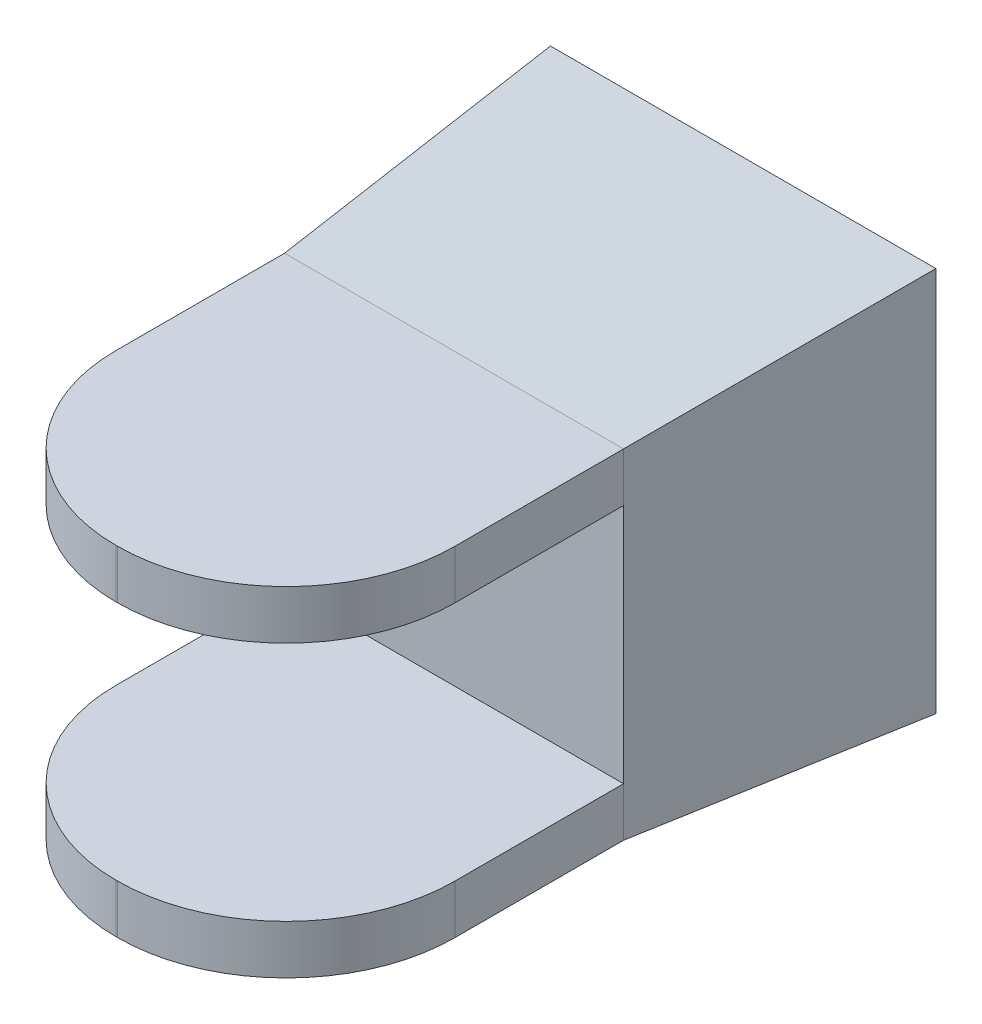
ISO-10303-21;
HEADER;
FILE_DESCRIPTION(('STEP AP214'),'2;1');
FILE_NAME('part.step','',(''),(''),'','','');
FILE_SCHEMA(('AUTOMOTIVE_DESIGN { 1 0 10303 214 1 1 1 1 }'));
ENDSEC;
DATA;
#1=APPLICATION_CONTEXT('core data for automotive mechanical design processes');
#2=APPLICATION_PROTOCOL_DEFINITION('international standard','automotive_design',2000,#1);
#3=PRODUCT_CONTEXT('',#1,'mechanical');
#4=PRODUCT('Part','Part','',(#3));
#5=PRODUCT_RELATED_PRODUCT_CATEGORY('part','',(#4));
#6=PRODUCT_DEFINITION_FORMATION('','',#4);
#7=PRODUCT_DEFINITION_CONTEXT('part definition',#1,'design');
#8=PRODUCT_DEFINITION('design','',#6,#7);
#9=PRODUCT_DEFINITION_SHAPE('','',#8);
#10=(LENGTH_UNIT() NAMED_UNIT(*) SI_UNIT(.MILLI.,.METRE.));
#11=(NAMED_UNIT(*) PLANE_ANGLE_UNIT() SI_UNIT($,.RADIAN.));
#12=(NAMED_UNIT(*) SI_UNIT($,.STERADIAN.) SOLID_ANGLE_UNIT());
#13=UNCERTAINTY_MEASURE_WITH_UNIT(LENGTH_MEASURE(1.E-05),#10,'distance_accuracy_value','');
#14=(GEOMETRIC_REPRESENTATION_CONTEXT(3) GLOBAL_UNCERTAINTY_ASSIGNED_CONTEXT((#13)) GLOBAL_UNIT_ASSIGNED_CONTEXT((#10,
#11,#12)) REPRESENTATION_CONTEXT('',''));
#15=CARTESIAN_POINT('',(0.,0.,0.));
#16=DIRECTION('',(0.,0.,1.));
#17=DIRECTION('',(1.,0.,0.));
#18=AXIS2_PLACEMENT_3D('',#15,#16,#17);
#19=CARTESIAN_POINT('',(0.172514623118826,-35.1725146231188,95.));
#20=DIRECTION('',(0.,-1.,0.));
#21=DIRECTION('',(0.,0.,-1.));
#22=AXIS2_PLACEMENT_3D('',#19,#20,#21);
#23=CYLINDRICAL_SURFACE('',#22,35.);
#24=CARTESIAN_POINT('',(0.172514623118826,25.,95.));
#25=DIRECTION('',(0.,1.,0.));
#26=DIRECTION('',(0.,0.,1.));
#27=AXIS2_PLACEMENT_3D('',#24,#25,#26);
#28=CIRCLE('',#27,35.);
#29=CARTESIAN_POINT('',(35.1725146231188,25.,95.));
#30=VERTEX_POINT('',#29);
#31=CARTESIAN_POINT('',(0.172514623118826,25.,130.));
#32=VERTEX_POINT('',#31);
#33=EDGE_CURVE('E215',#30,#32,#28,.F.);
#34=ORIENTED_EDGE('',*,*,#33,.F.);
#35=DIRECTION('',(0.,-1.,0.));
#36=VECTOR('',#35,1.);
#37=CARTESIAN_POINT('',(35.1725146231188,-35.1725146231188,95.));
#38=LINE('',#37,#36);
#39=CARTESIAN_POINT('',(35.1725146231188,35.1725146231188,95.));
#40=VERTEX_POINT('',#39);
#41=EDGE_CURVE('E195',#40,#30,#38,.T.);
#42=ORIENTED_EDGE('',*,*,#41,.F.);
#43=CARTESIAN_POINT('',(0.172514623118826,35.1725146231188,95.));
#44=DIRECTION('',(0.,-1.,0.));
#45=DIRECTION('',(0.,0.,-1.));
#46=AXIS2_PLACEMENT_3D('',#43,#44,#45);
#47=CIRCLE('',#46,35.);
#48=CARTESIAN_POINT('',(0.172514623118826,35.1725146231188,130.));
#49=VERTEX_POINT('',#48);
#50=EDGE_CURVE('E202',#49,#40,#47,.F.);
#51=ORIENTED_EDGE('',*,*,#50,.F.);
#52=DIRECTION('',(0.,-1.,0.));
#53=VECTOR('',#52,1.);
#54=CARTESIAN_POINT('',(0.172514623118826,0.,130.));
#55=LINE('',#54,#53);
#56=EDGE_CURVE('E198',#32,#49,#55,.F.);
#57=ORIENTED_EDGE('',*,*,#56,.F.);
#58=EDGE_LOOP('',(#34,#42,#51,#57));
#59=FACE_BOUND('',#58,.T.);
#60=ADVANCED_FACE('F34',(#59),#23,.T.);
#61=CARTESIAN_POINT('',(-0.172514623118826,-35.1725146231188,95.));
#62=DIRECTION('',(0.,1.,0.));
#63=DIRECTION('',(0.,0.,1.));
#64=AXIS2_PLACEMENT_3D('',#61,#62,#63);
#65=CYLINDRICAL_SURFACE('',#64,35.);
#66=CARTESIAN_POINT('',(-0.172514623118826,25.,95.));
#67=DIRECTION('',(0.,1.,0.));
#68=DIRECTION('',(0.,0.,1.));
#69=AXIS2_PLACEMENT_3D('',#66,#67,#68);
#70=CIRCLE('',#69,35.);
#71=CARTESIAN_POINT('',(-0.172514623118826,25.,130.));
#72=VERTEX_POINT('',#71);
#73=CARTESIAN_POINT('',(-35.1725146231188,25.,95.));
#74=VERTEX_POINT('',#73);
#75=EDGE_CURVE('E219',#72,#74,#70,.F.);
#76=ORIENTED_EDGE('',*,*,#75,.F.);
#77=DIRECTION('',(0.,1.,0.));
#78=VECTOR('',#77,1.);
#79=CARTESIAN_POINT('',(-0.172514623118826,0.,130.));
#80=LINE('',#79,#78);
#81=CARTESIAN_POINT('',(-0.172514623118826,35.1725146231188,130.));
#82=VERTEX_POINT('',#81);
#83=EDGE_CURVE('E186',#82,#72,#80,.F.);
#84=ORIENTED_EDGE('',*,*,#83,.F.);
#85=CARTESIAN_POINT('',(-0.172514623118826,35.1725146231188,95.));
#86=DIRECTION('',(0.,-1.,0.));
#87=DIRECTION('',(0.,0.,-1.));
#88=AXIS2_PLACEMENT_3D('',#85,#86,#87);
#89=CIRCLE('',#88,35.);
#90=CARTESIAN_POINT('',(-35.1725146231188,35.1725146231188,95.));
#91=VERTEX_POINT('',#90);
#92=EDGE_CURVE('E191',#91,#82,#89,.F.);
#93=ORIENTED_EDGE('',*,*,#92,.F.);
#94=DIRECTION('',(0.,1.,0.));
#95=VECTOR('',#94,1.);
#96=CARTESIAN_POINT('',(-35.1725146231188,-35.1725146231188,95.));
#97=LINE('',#96,#95);
#98=EDGE_CURVE('E185',#74,#91,#97,.T.);
#99=ORIENTED_EDGE('',*,*,#98,.F.);
#100=EDGE_LOOP('',(#76,#84,#93,#99));
#101=FACE_BOUND('',#100,.T.);
#102=ADVANCED_FACE('F286',(#101),#65,.T.);
#103=CARTESIAN_POINT('',(-35.1725146231188,-35.1725146231188,130.));
#104=DIRECTION('',(1.,0.,0.));
#105=DIRECTION('',(0.,0.,-1.));
#106=AXIS2_PLACEMENT_3D('',#103,#104,#105);
#107=PLANE('',#106);
#108=DIRECTION('',(0.,1.,0.));
#109=VECTOR('',#108,1.);
#110=CARTESIAN_POINT('',(-35.1725146231188,0.,60.));
#111=LINE('',#110,#109);
#112=CARTESIAN_POINT('',(-35.1725146231188,35.1725146231188,60.));
#113=VERTEX_POINT('',#112);
#114=CARTESIAN_POINT('',(-35.1725146231188,25.,60.));
#115=VERTEX_POINT('',#114);
#116=EDGE_CURVE('E171',#113,#115,#111,.F.);
#117=ORIENTED_EDGE('',*,*,#116,.T.);
#118=DIRECTION('',(0.,0.,1.));
#119=VECTOR('',#118,1.);
#120=CARTESIAN_POINT('',(-35.1725146231188,25.,60.));
#121=LINE('',#120,#119);
#122=EDGE_CURVE('E280',#115,#74,#121,.T.);
#123=ORIENTED_EDGE('',*,*,#122,.T.);
#124=ORIENTED_EDGE('',*,*,#98,.T.);
#125=DIRECTION('',(0.,0.,-1.));
#126=VECTOR('',#125,1.);
#127=CARTESIAN_POINT('',(-35.1725146231188,35.1725146231188,130.));
#128=LINE('',#127,#126);
#129=EDGE_CURVE('E217',#91,#113,#128,.T.);
#130=ORIENTED_EDGE('',*,*,#129,.T.);
#131=EDGE_LOOP('',(#117,#123,#124,#130));
#132=FACE_BOUND('',#131,.T.);
#133=ADVANCED_FACE('F279',(#132),#107,.F.);
#134=CARTESIAN_POINT('',(35.1725146231188,-35.1725146231188,130.));
#135=DIRECTION('',(-1.,0.,0.));
#136=DIRECTION('',(0.,0.,1.));
#137=AXIS2_PLACEMENT_3D('',#134,#135,#136);
#138=PLANE('',#137);
#139=ORIENTED_EDGE('',*,*,#41,.T.);
#140=DIRECTION('',(0.,0.,1.));
#141=VECTOR('',#140,1.);
#142=CARTESIAN_POINT('',(35.1725146231188,25.,60.));
#143=LINE('',#142,#141);
#144=CARTESIAN_POINT('',(35.1725146231188,25.,60.));
#145=VERTEX_POINT('',#144);
#146=EDGE_CURVE('E257',#145,#30,#143,.T.);
#147=ORIENTED_EDGE('',*,*,#146,.F.);
#148=DIRECTION('',(0.,-1.,0.));
#149=VECTOR('',#148,1.);
#150=CARTESIAN_POINT('',(35.1725146231188,0.,60.));
#151=LINE('',#150,#149);
#152=CARTESIAN_POINT('',(35.1725146231188,35.1725146231188,60.));
#153=VERTEX_POINT('',#152);
#154=EDGE_CURVE('E240',#145,#153,#151,.F.);
#155=ORIENTED_EDGE('',*,*,#154,.T.);
#156=DIRECTION('',(0.,0.,-1.));
#157=VECTOR('',#156,1.);
#158=CARTESIAN_POINT('',(35.1725146231188,35.1725146231188,130.));
#159=LINE('',#158,#157);
#160=EDGE_CURVE('E224',#40,#153,#159,.T.);
#161=ORIENTED_EDGE('',*,*,#160,.F.);
#162=EDGE_LOOP('',(#139,#147,#155,#161));
#163=FACE_BOUND('',#162,.T.);
#164=ADVANCED_FACE('F256',(#163),#138,.F.);
#165=CARTESIAN_POINT('',(0.,0.,130.));
#166=DIRECTION('',(0.,0.,-1.));
#167=DIRECTION('',(-1.,0.,0.));
#168=AXIS2_PLACEMENT_3D('',#165,#166,#167);
#169=PLANE('',#168);
#170=ORIENTED_EDGE('',*,*,#83,.T.);
#171=DIRECTION('',(1.,0.,0.));
#172=VECTOR('',#171,1.);
#173=CARTESIAN_POINT('',(0.,25.,130.));
#174=LINE('',#173,#172);
#175=EDGE_CURVE('E11',#72,#32,#174,.T.);
#176=ORIENTED_EDGE('',*,*,#175,.T.);
#177=ORIENTED_EDGE('',*,*,#56,.T.);
#178=DIRECTION('',(-1.,0.,0.));
#179=VECTOR('',#178,1.);
#180=CARTESIAN_POINT('',(-35.1725146231188,35.1725146231188,130.));
#181=LINE('',#180,#179);
#182=EDGE_CURVE('E214',#49,#82,#181,.T.);
#183=ORIENTED_EDGE('',*,*,#182,.T.);
#184=EDGE_LOOP('',(#170,#176,#177,#183));
#185=FACE_BOUND('',#184,.T.);
#186=ADVANCED_FACE('F288',(#185),#169,.F.);
#187=CARTESIAN_POINT('',(0.172514623118826,-25.,95.));
#188=DIRECTION('',(0.,-1.,0.));
#189=DIRECTION('',(0.,0.,-1.));
#190=AXIS2_PLACEMENT_3D('',#187,#188,#189);
#191=CIRCLE('',#190,35.);
#192=CARTESIAN_POINT('',(0.172514623118826,-25.,130.));
#193=VERTEX_POINT('',#192);
#194=CARTESIAN_POINT('',(35.1725146231188,-25.,95.));
#195=VERTEX_POINT('',#194);
#196=EDGE_CURVE('E300',#193,#195,#191,.F.);
#197=ORIENTED_EDGE('',*,*,#196,.F.);
#198=CARTESIAN_POINT('',(0.172514623118826,-35.1725146231188,130.));
#199=VERTEX_POINT('',#198);
#200=EDGE_CURVE('E199',#199,#193,#55,.F.);
#201=ORIENTED_EDGE('',*,*,#200,.F.);
#202=CARTESIAN_POINT('',(0.172514623118826,-35.1725146231188,95.));
#203=DIRECTION('',(0.,1.,0.));
#204=DIRECTION('',(0.,0.,1.));
#205=AXIS2_PLACEMENT_3D('',#202,#203,#204);
#206=CIRCLE('',#205,35.);
#207=CARTESIAN_POINT('',(35.1725146231188,-35.1725146231188,95.));
#208=VERTEX_POINT('',#207);
#209=EDGE_CURVE('E57',#208,#199,#206,.F.);
#210=ORIENTED_EDGE('',*,*,#209,.F.);
#211=EDGE_CURVE('E194',#195,#208,#38,.T.);
#212=ORIENTED_EDGE('',*,*,#211,.F.);
#213=EDGE_LOOP('',(#197,#201,#210,#212));
#214=FACE_BOUND('',#213,.T.);
#215=ADVANCED_FACE('F36',(#214),#23,.T.);
#216=CARTESIAN_POINT('',(-0.172514623118826,-25.,95.));
#217=DIRECTION('',(0.,-1.,0.));
#218=DIRECTION('',(0.,0.,-1.));
#219=AXIS2_PLACEMENT_3D('',#216,#217,#218);
#220=CIRCLE('',#219,35.);
#221=CARTESIAN_POINT('',(-35.1725146231188,-25.,95.));
#222=VERTEX_POINT('',#221);
#223=CARTESIAN_POINT('',(-0.172514623118826,-25.,130.));
#224=VERTEX_POINT('',#223);
#225=EDGE_CURVE('E49',#222,#224,#220,.F.);
#226=ORIENTED_EDGE('',*,*,#225,.F.);
#227=CARTESIAN_POINT('',(-35.1725146231188,-35.1725146231188,95.));
#228=VERTEX_POINT('',#227);
#229=EDGE_CURVE('E164',#228,#222,#97,.T.);
#230=ORIENTED_EDGE('',*,*,#229,.F.);
#231=CARTESIAN_POINT('',(-0.172514623118826,-35.1725146231188,95.));
#232=DIRECTION('',(0.,1.,0.));
#233=DIRECTION('',(0.,0.,1.));
#234=AXIS2_PLACEMENT_3D('',#231,#232,#233);
#235=CIRCLE('',#234,35.);
#236=CARTESIAN_POINT('',(-0.172514623118826,-35.1725146231188,130.));
#237=VERTEX_POINT('',#236);
#238=EDGE_CURVE('E189',#237,#228,#235,.F.);
#239=ORIENTED_EDGE('',*,*,#238,.F.);
#240=EDGE_CURVE('E184',#224,#237,#80,.F.);
#241=ORIENTED_EDGE('',*,*,#240,.F.);
#242=EDGE_LOOP('',(#226,#230,#239,#241));
#243=FACE_BOUND('',#242,.T.);
#244=ADVANCED_FACE('F211',(#243),#65,.T.);
#245=CARTESIAN_POINT('',(40.,-40.,0.));
#246=DIRECTION('',(0.996778878456247,0.,0.0801989243288591));
#247=DIRECTION('',(0.0801989243288591,0.,-0.996778878456247));
#248=AXIS2_PLACEMENT_3D('',#245,#246,#247);
#249=PLANE('',#248);
#250=DIRECTION('',(0.,1.,0.));
#251=VECTOR('',#250,1.);
#252=CARTESIAN_POINT('',(40.,-40.,0.));
#253=LINE('',#252,#251);
#254=CARTESIAN_POINT('',(40.,-40.,0.));
#255=VERTEX_POINT('',#254);
#256=CARTESIAN_POINT('',(40.,40.,0.));
#257=VERTEX_POINT('',#256);
#258=EDGE_CURVE('E231',#255,#257,#253,.T.);
#259=ORIENTED_EDGE('',*,*,#258,.T.);
#260=DIRECTION('',(0.0799422474252014,0.0799422474252014,-0.99358868459399));
#261=VECTOR('',#260,1.);
#262=CARTESIAN_POINT('',(39.4887389661286,39.4887389661286,6.35437699701545));
#263=LINE('',#262,#261);
#264=EDGE_CURVE('E241',#153,#257,#263,.T.);
#265=ORIENTED_EDGE('',*,*,#264,.F.);
#266=ORIENTED_EDGE('',*,*,#154,.F.);
#267=DIRECTION('',(0.,1.,0.));
#268=VECTOR('',#267,1.);
#269=CARTESIAN_POINT('',(35.1725146231188,-25.,60.));
#270=LINE('',#269,#268);
#271=CARTESIAN_POINT('',(35.1725146231188,-25.,60.));
#272=VERTEX_POINT('',#271);
#273=EDGE_CURVE('E144',#272,#145,#270,.T.);
#274=ORIENTED_EDGE('',*,*,#273,.F.);
#275=CARTESIAN_POINT('',(35.1725146231188,-35.1725146231188,60.));
#276=VERTEX_POINT('',#275);
#277=EDGE_CURVE('E176',#276,#272,#151,.F.);
#278=ORIENTED_EDGE('',*,*,#277,.F.);
#279=DIRECTION('',(0.0799422474252014,-0.0799422474252014,-0.99358868459399));
#280=VECTOR('',#279,1.);
#281=CARTESIAN_POINT('',(40.,-40.,0.));
#282=LINE('',#281,#280);
#283=EDGE_CURVE('E182',#276,#255,#282,.T.);
#284=ORIENTED_EDGE('',*,*,#283,.T.);
#285=EDGE_LOOP('',(#259,#265,#266,#274,#278,#284));
#286=FACE_BOUND('',#285,.T.);
#287=ADVANCED_FACE('F270',(#286),#249,.T.);
#288=CARTESIAN_POINT('',(-40.,40.,0.));
#289=DIRECTION('',(0.,0.996778878456247,0.0801989243288591));
#290=DIRECTION('',(0.,-0.0801989243288591,0.996778878456247));
#291=AXIS2_PLACEMENT_3D('',#288,#289,#290);
#292=PLANE('',#291);
#293=DIRECTION('',(-1.,0.,0.));
#294=VECTOR('',#293,1.);
#295=CARTESIAN_POINT('',(-40.,40.,0.));
#296=LINE('',#295,#294);
#297=CARTESIAN_POINT('',(-40.,40.,0.));
#298=VERTEX_POINT('',#297);
#299=EDGE_CURVE('E234',#257,#298,#296,.T.);
#300=ORIENTED_EDGE('',*,*,#299,.T.);
#301=DIRECTION('',(-0.0799422474252014,0.0799422474252014,-0.99358868459399));
#302=VECTOR('',#301,1.);
#303=CARTESIAN_POINT('',(-39.4887389661286,39.4887389661286,6.35437699701545));
#304=LINE('',#303,#302);
#305=EDGE_CURVE('E244',#113,#298,#304,.T.);
#306=ORIENTED_EDGE('',*,*,#305,.F.);
#307=DIRECTION('',(1.,0.,0.));
#308=VECTOR('',#307,1.);
#309=CARTESIAN_POINT('',(0.,35.1725146231188,60.));
#310=LINE('',#309,#308);
#311=EDGE_CURVE('E172',#153,#113,#310,.F.);
#312=ORIENTED_EDGE('',*,*,#311,.F.);
#313=ORIENTED_EDGE('',*,*,#264,.T.);
#314=EDGE_LOOP('',(#300,#306,#312,#313));
#315=FACE_BOUND('',#314,.T.);
#316=ADVANCED_FACE('F269',(#315),#292,.T.);
#317=CARTESIAN_POINT('',(-40.,-40.,0.));
#318=DIRECTION('',(-0.996778878456247,0.,0.0801989243288591));
#319=DIRECTION('',(0.0801989243288591,0.,0.996778878456247));
#320=AXIS2_PLACEMENT_3D('',#317,#318,#319);
#321=PLANE('',#320);
#322=DIRECTION('',(0.,-1.,0.));
#323=VECTOR('',#322,1.);
#324=CARTESIAN_POINT('',(-40.,-40.,0.));
#325=LINE('',#324,#323);
#326=CARTESIAN_POINT('',(-40.,-40.,0.));
#327=VERTEX_POINT('',#326);
#328=EDGE_CURVE('E236',#298,#327,#325,.T.);
#329=ORIENTED_EDGE('',*,*,#328,.T.);
#330=DIRECTION('',(-0.0799422474252014,-0.0799422474252014,-0.99358868459399));
#331=VECTOR('',#330,1.);
#332=CARTESIAN_POINT('',(-40.,-40.,0.));
#333=LINE('',#332,#331);
#334=CARTESIAN_POINT('',(-35.1725146231188,-35.1725146231188,60.));
#335=VERTEX_POINT('',#334);
#336=EDGE_CURVE('E169',#335,#327,#333,.T.);
#337=ORIENTED_EDGE('',*,*,#336,.F.);
#338=CARTESIAN_POINT('',(-35.1725146231188,-25.,60.));
#339=VERTEX_POINT('',#338);
#340=EDGE_CURVE('E161',#339,#335,#111,.F.);
#341=ORIENTED_EDGE('',*,*,#340,.F.);
#342=DIRECTION('',(0.,-1.,0.));
#343=VECTOR('',#342,1.);
#344=CARTESIAN_POINT('',(-35.1725146231188,-25.,60.));
#345=LINE('',#344,#343);
#346=EDGE_CURVE('E145',#115,#339,#345,.T.);
#347=ORIENTED_EDGE('',*,*,#346,.F.);
#348=ORIENTED_EDGE('',*,*,#116,.F.);
#349=ORIENTED_EDGE('',*,*,#305,.T.);
#350=EDGE_LOOP('',(#329,#337,#341,#347,#348,#349));
#351=FACE_BOUND('',#350,.T.);
#352=ADVANCED_FACE('F167',(#351),#321,.T.);
#353=CARTESIAN_POINT('',(-40.,-40.,0.));
#354=DIRECTION('',(0.,-0.996778878456247,0.0801989243288591));
#355=DIRECTION('',(0.,-0.0801989243288591,-0.996778878456247));
#356=AXIS2_PLACEMENT_3D('',#353,#354,#355);
#357=PLANE('',#356);
#358=DIRECTION('',(1.,0.,0.));
#359=VECTOR('',#358,1.);
#360=CARTESIAN_POINT('',(-40.,-40.,0.));
#361=LINE('',#360,#359);
#362=EDGE_CURVE('E238',#327,#255,#361,.T.);
#363=ORIENTED_EDGE('',*,*,#362,.T.);
#364=ORIENTED_EDGE('',*,*,#283,.F.);
#365=DIRECTION('',(-1.,0.,0.));
#366=VECTOR('',#365,1.);
#367=CARTESIAN_POINT('',(0.,-35.1725146231188,60.));
#368=LINE('',#367,#366);
#369=EDGE_CURVE('E174',#335,#276,#368,.F.);
#370=ORIENTED_EDGE('',*,*,#369,.F.);
#371=ORIENTED_EDGE('',*,*,#336,.T.);
#372=EDGE_LOOP('',(#363,#364,#370,#371));
#373=FACE_BOUND('',#372,.T.);
#374=ADVANCED_FACE('F305',(#373),#357,.T.);
#375=CARTESIAN_POINT('',(0.,0.,0.));
#376=DIRECTION('',(0.,0.,-1.));
#377=DIRECTION('',(-1.,0.,0.));
#378=AXIS2_PLACEMENT_3D('',#375,#376,#377);
#379=PLANE('',#378);
#380=ORIENTED_EDGE('',*,*,#258,.F.);
#381=ORIENTED_EDGE('',*,*,#362,.F.);
#382=ORIENTED_EDGE('',*,*,#328,.F.);
#383=ORIENTED_EDGE('',*,*,#299,.F.);
#384=EDGE_LOOP('',(#380,#381,#382,#383));
#385=FACE_BOUND('',#384,.T.);
#386=ADVANCED_FACE('F275',(#385),#379,.T.);
#387=ORIENTED_EDGE('',*,*,#229,.T.);
#388=DIRECTION('',(0.,0.,1.));
#389=VECTOR('',#388,1.);
#390=CARTESIAN_POINT('',(-35.1725146231188,-25.,60.));
#391=LINE('',#390,#389);
#392=EDGE_CURVE('E139',#339,#222,#391,.T.);
#393=ORIENTED_EDGE('',*,*,#392,.F.);
#394=ORIENTED_EDGE('',*,*,#340,.T.);
#395=DIRECTION('',(0.,0.,-1.));
#396=VECTOR('',#395,1.);
#397=CARTESIAN_POINT('',(-35.1725146231188,-35.1725146231188,130.));
#398=LINE('',#397,#396);
#399=EDGE_CURVE('E229',#228,#335,#398,.T.);
#400=ORIENTED_EDGE('',*,*,#399,.F.);
#401=EDGE_LOOP('',(#387,#393,#394,#400));
#402=FACE_BOUND('',#401,.T.);
#403=ADVANCED_FACE('F159',(#402),#107,.F.);
#404=CARTESIAN_POINT('',(-35.1725146231188,-35.1725146231188,130.));
#405=DIRECTION('',(0.,1.,0.));
#406=DIRECTION('',(0.,0.,1.));
#407=AXIS2_PLACEMENT_3D('',#404,#405,#406);
#408=PLANE('',#407);
#409=DIRECTION('',(0.,0.,-1.));
#410=VECTOR('',#409,1.);
#411=CARTESIAN_POINT('',(35.1725146231188,-35.1725146231188,130.));
#412=LINE('',#411,#410);
#413=EDGE_CURVE('E227',#208,#276,#412,.T.);
#414=ORIENTED_EDGE('',*,*,#413,.F.);
#415=ORIENTED_EDGE('',*,*,#209,.T.);
#416=DIRECTION('',(1.,0.,0.));
#417=VECTOR('',#416,1.);
#418=CARTESIAN_POINT('',(-35.1725146231188,-35.1725146231188,130.));
#419=LINE('',#418,#417);
#420=EDGE_CURVE('E212',#237,#199,#419,.T.);
#421=ORIENTED_EDGE('',*,*,#420,.F.);
#422=ORIENTED_EDGE('',*,*,#238,.T.);
#423=ORIENTED_EDGE('',*,*,#399,.T.);
#424=ORIENTED_EDGE('',*,*,#369,.T.);
#425=EDGE_LOOP('',(#414,#415,#421,#422,#423,#424));
#426=FACE_BOUND('',#425,.T.);
#427=ADVANCED_FACE('F213',(#426),#408,.F.);
#428=ORIENTED_EDGE('',*,*,#277,.T.);
#429=DIRECTION('',(0.,0.,1.));
#430=VECTOR('',#429,1.);
#431=CARTESIAN_POINT('',(35.1725146231188,-25.,60.));
#432=LINE('',#431,#430);
#433=EDGE_CURVE('E141',#272,#195,#432,.T.);
#434=ORIENTED_EDGE('',*,*,#433,.T.);
#435=ORIENTED_EDGE('',*,*,#211,.T.);
#436=ORIENTED_EDGE('',*,*,#413,.T.);
#437=EDGE_LOOP('',(#428,#434,#435,#436));
#438=FACE_BOUND('',#437,.T.);
#439=ADVANCED_FACE('F303',(#438),#138,.F.);
#440=CARTESIAN_POINT('',(-35.1725146231188,35.1725146231188,130.));
#441=DIRECTION('',(0.,-1.,0.));
#442=DIRECTION('',(0.,0.,-1.));
#443=AXIS2_PLACEMENT_3D('',#440,#441,#442);
#444=PLANE('',#443);
#445=ORIENTED_EDGE('',*,*,#182,.F.);
#446=ORIENTED_EDGE('',*,*,#50,.T.);
#447=ORIENTED_EDGE('',*,*,#160,.T.);
#448=ORIENTED_EDGE('',*,*,#311,.T.);
#449=ORIENTED_EDGE('',*,*,#129,.F.);
#450=ORIENTED_EDGE('',*,*,#92,.T.);
#451=EDGE_LOOP('',(#445,#446,#447,#448,#449,#450));
#452=FACE_BOUND('',#451,.T.);
#453=ADVANCED_FACE('F263',(#452),#444,.F.);
#454=ORIENTED_EDGE('',*,*,#200,.T.);
#455=DIRECTION('',(-1.,0.,0.));
#456=VECTOR('',#455,1.);
#457=CARTESIAN_POINT('',(0.,-25.,130.));
#458=LINE('',#457,#456);
#459=EDGE_CURVE('E42',#193,#224,#458,.T.);
#460=ORIENTED_EDGE('',*,*,#459,.T.);
#461=ORIENTED_EDGE('',*,*,#240,.T.);
#462=ORIENTED_EDGE('',*,*,#420,.T.);
#463=EDGE_LOOP('',(#454,#460,#461,#462));
#464=FACE_BOUND('',#463,.T.);
#465=ADVANCED_FACE('F206',(#464),#169,.F.);
#466=CARTESIAN_POINT('',(35.1725146231188,25.,60.));
#467=DIRECTION('',(0.,1.,0.));
#468=DIRECTION('',(0.,0.,1.));
#469=AXIS2_PLACEMENT_3D('',#466,#467,#468);
#470=PLANE('',#469);
#471=ORIENTED_EDGE('',*,*,#33,.T.);
#472=ORIENTED_EDGE('',*,*,#175,.F.);
#473=ORIENTED_EDGE('',*,*,#75,.T.);
#474=ORIENTED_EDGE('',*,*,#122,.F.);
#475=DIRECTION('',(-1.,0.,0.));
#476=VECTOR('',#475,1.);
#477=CARTESIAN_POINT('',(35.1725146231188,25.,60.));
#478=LINE('',#477,#476);
#479=EDGE_CURVE('E151',#145,#115,#478,.T.);
#480=ORIENTED_EDGE('',*,*,#479,.F.);
#481=ORIENTED_EDGE('',*,*,#146,.T.);
#482=EDGE_LOOP('',(#471,#472,#473,#474,#480,#481));
#483=FACE_BOUND('',#482,.T.);
#484=ADVANCED_FACE('F293',(#483),#470,.F.);
#485=CARTESIAN_POINT('',(35.1725146231188,-25.,60.));
#486=DIRECTION('',(0.,-1.,0.));
#487=DIRECTION('',(0.,0.,-1.));
#488=AXIS2_PLACEMENT_3D('',#485,#486,#487);
#489=PLANE('',#488);
#490=ORIENTED_EDGE('',*,*,#196,.T.);
#491=ORIENTED_EDGE('',*,*,#433,.F.);
#492=DIRECTION('',(1.,0.,0.));
#493=VECTOR('',#492,1.);
#494=CARTESIAN_POINT('',(35.1725146231188,-25.,60.));
#495=LINE('',#494,#493);
#496=EDGE_CURVE('E135',#339,#272,#495,.T.);
#497=ORIENTED_EDGE('',*,*,#496,.F.);
#498=ORIENTED_EDGE('',*,*,#392,.T.);
#499=ORIENTED_EDGE('',*,*,#225,.T.);
#500=ORIENTED_EDGE('',*,*,#459,.F.);
#501=EDGE_LOOP('',(#490,#491,#497,#498,#499,#500));
#502=FACE_BOUND('',#501,.T.);
#503=ADVANCED_FACE('F137',(#502),#489,.F.);
#504=CARTESIAN_POINT('',(0.,0.,60.));
#505=DIRECTION('',(0.,0.,1.));
#506=DIRECTION('',(1.,0.,0.));
#507=AXIS2_PLACEMENT_3D('',#504,#505,#506);
#508=PLANE('',#507);
#509=ORIENTED_EDGE('',*,*,#346,.T.);
#510=ORIENTED_EDGE('',*,*,#496,.T.);
#511=ORIENTED_EDGE('',*,*,#273,.T.);
#512=ORIENTED_EDGE('',*,*,#479,.T.);
#513=EDGE_LOOP('',(#509,#510,#511,#512));
#514=FACE_BOUND('',#513,.T.);
#515=ADVANCED_FACE('F149',(#514),#508,.T.);
#516=CLOSED_SHELL('',(#60,#102,#133,#164,#186,#215,#244,#287,#316,#352,#374,#386,#403,#427,#439,
#453,#465,#484,#503,#515));
#517=MANIFOLD_SOLID_BREP('B2',#516);
#518=ADVANCED_BREP_SHAPE_REPRESENTATION('',(#18,#517),#14);
#519=SHAPE_DEFINITION_REPRESENTATION(#9,#518);
ENDSEC;
END-ISO-10303-21;
